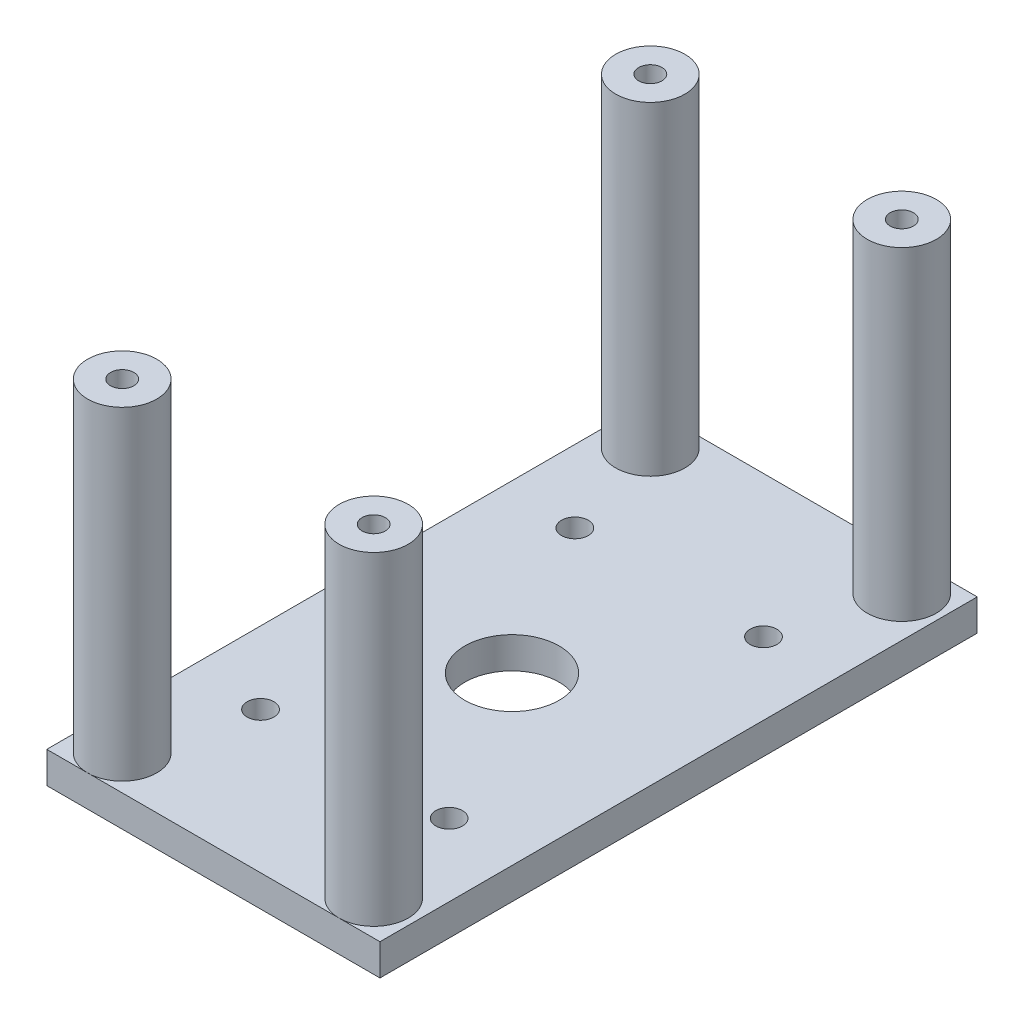
ISO-10303-21;
HEADER;
FILE_DESCRIPTION(('STEP AP214'),'2;1');
FILE_NAME('part.step','',(''),(''),'','','');
FILE_SCHEMA(('AUTOMOTIVE_DESIGN { 1 0 10303 214 1 1 1 1 }'));
ENDSEC;
DATA;
#1=APPLICATION_CONTEXT('core data for automotive mechanical design processes');
#2=APPLICATION_PROTOCOL_DEFINITION('international standard','automotive_design',2000,#1);
#3=PRODUCT_CONTEXT('',#1,'mechanical');
#4=PRODUCT('Part','Part','',(#3));
#5=PRODUCT_RELATED_PRODUCT_CATEGORY('part','',(#4));
#6=PRODUCT_DEFINITION_FORMATION('','',#4);
#7=PRODUCT_DEFINITION_CONTEXT('part definition',#1,'design');
#8=PRODUCT_DEFINITION('design','',#6,#7);
#9=PRODUCT_DEFINITION_SHAPE('','',#8);
#10=(LENGTH_UNIT() NAMED_UNIT(*) SI_UNIT(.MILLI.,.METRE.));
#11=(NAMED_UNIT(*) PLANE_ANGLE_UNIT() SI_UNIT($,.RADIAN.));
#12=(NAMED_UNIT(*) SI_UNIT($,.STERADIAN.) SOLID_ANGLE_UNIT());
#13=UNCERTAINTY_MEASURE_WITH_UNIT(LENGTH_MEASURE(1.E-05),#10,'distance_accuracy_value','');
#14=(GEOMETRIC_REPRESENTATION_CONTEXT(3) GLOBAL_UNCERTAINTY_ASSIGNED_CONTEXT((#13)) GLOBAL_UNIT_ASSIGNED_CONTEXT((#10,
#11,#12)) REPRESENTATION_CONTEXT('',''));
#15=CARTESIAN_POINT('',(0.,0.,0.));
#16=DIRECTION('',(0.,0.,1.));
#17=DIRECTION('',(1.,0.,0.));
#18=AXIS2_PLACEMENT_3D('',#15,#16,#17);
#19=CARTESIAN_POINT('',(0.,5.,0.));
#20=DIRECTION('',(1.,0.,0.));
#21=DIRECTION('',(0.,0.,-1.));
#22=AXIS2_PLACEMENT_3D('',#19,#20,#21);
#23=PLANE('',#22);
#24=DIRECTION('',(0.,0.,1.));
#25=VECTOR('',#24,1.);
#26=CARTESIAN_POINT('',(0.,0.,0.));
#27=LINE('',#26,#25);
#28=CARTESIAN_POINT('',(0.,0.,-95.));
#29=VERTEX_POINT('',#28);
#30=CARTESIAN_POINT('',(0.,0.,0.));
#31=VERTEX_POINT('',#30);
#32=EDGE_CURVE('E130',#29,#31,#27,.T.);
#33=ORIENTED_EDGE('',*,*,#32,.T.);
#34=DIRECTION('',(0.,-1.,0.));
#35=VECTOR('',#34,1.);
#36=CARTESIAN_POINT('',(0.,5.,0.));
#37=LINE('',#36,#35);
#38=CARTESIAN_POINT('',(0.,5.,0.));
#39=VERTEX_POINT('',#38);
#40=EDGE_CURVE('E11',#39,#31,#37,.T.);
#41=ORIENTED_EDGE('',*,*,#40,.F.);
#42=DIRECTION('',(0.,0.,1.));
#43=VECTOR('',#42,1.);
#44=CARTESIAN_POINT('',(0.,5.,0.));
#45=LINE('',#44,#43);
#46=CARTESIAN_POINT('',(0.,5.,-95.));
#47=VERTEX_POINT('',#46);
#48=EDGE_CURVE('E116',#47,#39,#45,.T.);
#49=ORIENTED_EDGE('',*,*,#48,.F.);
#50=DIRECTION('',(0.,-1.,0.));
#51=VECTOR('',#50,1.);
#52=CARTESIAN_POINT('',(0.,5.,-95.));
#53=LINE('',#52,#51);
#54=EDGE_CURVE('E129',#47,#29,#53,.T.);
#55=ORIENTED_EDGE('',*,*,#54,.T.);
#56=EDGE_LOOP('',(#33,#41,#49,#55));
#57=FACE_BOUND('',#56,.T.);
#58=ADVANCED_FACE('F39',(#57),#23,.F.);
#59=CARTESIAN_POINT('',(0.,5.,0.));
#60=DIRECTION('',(0.,0.,-1.));
#61=DIRECTION('',(-1.,0.,0.));
#62=AXIS2_PLACEMENT_3D('',#59,#60,#61);
#63=PLANE('',#62);
#64=DIRECTION('',(1.,0.,0.));
#65=VECTOR('',#64,1.);
#66=CARTESIAN_POINT('',(0.,0.,0.));
#67=LINE('',#66,#65);
#68=CARTESIAN_POINT('',(53.,0.,0.));
#69=VERTEX_POINT('',#68);
#70=EDGE_CURVE('E134',#31,#69,#67,.T.);
#71=ORIENTED_EDGE('',*,*,#70,.T.);
#72=DIRECTION('',(0.,-1.,0.));
#73=VECTOR('',#72,1.);
#74=CARTESIAN_POINT('',(53.,5.,0.));
#75=LINE('',#74,#73);
#76=CARTESIAN_POINT('',(53.,5.,0.));
#77=VERTEX_POINT('',#76);
#78=EDGE_CURVE('E48',#77,#69,#75,.T.);
#79=ORIENTED_EDGE('',*,*,#78,.F.);
#80=DIRECTION('',(1.,0.,0.));
#81=VECTOR('',#80,1.);
#82=CARTESIAN_POINT('',(0.,5.,0.));
#83=LINE('',#82,#81);
#84=CARTESIAN_POINT('',(46.5,5.,0.));
#85=VERTEX_POINT('',#84);
#86=EDGE_CURVE('E110',#85,#77,#83,.T.);
#87=ORIENTED_EDGE('',*,*,#86,.F.);
#88=CARTESIAN_POINT('',(6.50000000000001,5.,0.));
#89=VERTEX_POINT('',#88);
#90=EDGE_CURVE('E102',#89,#85,#83,.T.);
#91=ORIENTED_EDGE('',*,*,#90,.F.);
#92=EDGE_CURVE('E88',#39,#89,#83,.T.);
#93=ORIENTED_EDGE('',*,*,#92,.F.);
#94=ORIENTED_EDGE('',*,*,#40,.T.);
#95=EDGE_LOOP('',(#71,#79,#87,#91,#93,#94));
#96=FACE_BOUND('',#95,.T.);
#97=ADVANCED_FACE('F113',(#96),#63,.F.);
#98=CARTESIAN_POINT('',(53.,5.,0.));
#99=DIRECTION('',(-1.,0.,0.));
#100=DIRECTION('',(0.,0.,1.));
#101=AXIS2_PLACEMENT_3D('',#98,#99,#100);
#102=PLANE('',#101);
#103=DIRECTION('',(0.,0.,-1.));
#104=VECTOR('',#103,1.);
#105=CARTESIAN_POINT('',(53.,0.,0.));
#106=LINE('',#105,#104);
#107=CARTESIAN_POINT('',(53.,0.,-95.));
#108=VERTEX_POINT('',#107);
#109=EDGE_CURVE('E75',#69,#108,#106,.T.);
#110=ORIENTED_EDGE('',*,*,#109,.T.);
#111=DIRECTION('',(0.,-1.,0.));
#112=VECTOR('',#111,1.);
#113=CARTESIAN_POINT('',(53.,5.,-95.));
#114=LINE('',#113,#112);
#115=CARTESIAN_POINT('',(53.,5.,-95.));
#116=VERTEX_POINT('',#115);
#117=EDGE_CURVE('E144',#116,#108,#114,.T.);
#118=ORIENTED_EDGE('',*,*,#117,.F.);
#119=DIRECTION('',(0.,0.,-1.));
#120=VECTOR('',#119,1.);
#121=CARTESIAN_POINT('',(53.,5.,0.));
#122=LINE('',#121,#120);
#123=EDGE_CURVE('E121',#77,#116,#122,.T.);
#124=ORIENTED_EDGE('',*,*,#123,.F.);
#125=ORIENTED_EDGE('',*,*,#78,.T.);
#126=EDGE_LOOP('',(#110,#118,#124,#125));
#127=FACE_BOUND('',#126,.T.);
#128=ADVANCED_FACE('F147',(#127),#102,.F.);
#129=CARTESIAN_POINT('',(0.,5.,-95.));
#130=DIRECTION('',(0.,0.,1.));
#131=DIRECTION('',(1.,0.,0.));
#132=AXIS2_PLACEMENT_3D('',#129,#130,#131);
#133=PLANE('',#132);
#134=DIRECTION('',(-1.,0.,0.));
#135=VECTOR('',#134,1.);
#136=CARTESIAN_POINT('',(0.,0.,-95.));
#137=LINE('',#136,#135);
#138=EDGE_CURVE('E81',#108,#29,#137,.T.);
#139=ORIENTED_EDGE('',*,*,#138,.T.);
#140=ORIENTED_EDGE('',*,*,#54,.F.);
#141=DIRECTION('',(-1.,0.,0.));
#142=VECTOR('',#141,1.);
#143=CARTESIAN_POINT('',(0.,5.,-95.));
#144=LINE('',#143,#142);
#145=CARTESIAN_POINT('',(6.50000000000001,5.,-95.));
#146=VERTEX_POINT('',#145);
#147=EDGE_CURVE('E56',#146,#47,#144,.T.);
#148=ORIENTED_EDGE('',*,*,#147,.F.);
#149=CARTESIAN_POINT('',(46.5,5.,-95.));
#150=VERTEX_POINT('',#149);
#151=EDGE_CURVE('E124',#150,#146,#144,.T.);
#152=ORIENTED_EDGE('',*,*,#151,.F.);
#153=EDGE_CURVE('E126',#116,#150,#144,.T.);
#154=ORIENTED_EDGE('',*,*,#153,.F.);
#155=ORIENTED_EDGE('',*,*,#117,.T.);
#156=EDGE_LOOP('',(#139,#140,#148,#152,#154,#155));
#157=FACE_BOUND('',#156,.T.);
#158=ADVANCED_FACE('F154',(#157),#133,.F.);
#159=CARTESIAN_POINT('',(0.,5.,0.));
#160=DIRECTION('',(0.,-1.,0.));
#161=DIRECTION('',(0.,0.,-1.));
#162=AXIS2_PLACEMENT_3D('',#159,#160,#161);
#163=PLANE('',#162);
#164=CARTESIAN_POINT('',(41.5,5.,-22.5));
#165=DIRECTION('',(0.,1.,0.));
#166=DIRECTION('',(0.,0.,1.));
#167=AXIS2_PLACEMENT_3D('',#164,#165,#166);
#168=CIRCLE('',#167,2.125);
#169=CARTESIAN_POINT('',(41.5,5.,-20.375));
#170=VERTEX_POINT('',#169);
#171=EDGE_CURVE('E438',#170,#170,#168,.T.);
#172=ORIENTED_EDGE('',*,*,#171,.F.);
#173=EDGE_LOOP('',(#172));
#174=FACE_BOUND('',#173,.T.);
#175=CARTESIAN_POINT('',(11.5,5.,-22.5));
#176=DIRECTION('',(0.,1.,0.));
#177=DIRECTION('',(0.,0.,1.));
#178=AXIS2_PLACEMENT_3D('',#175,#176,#177);
#179=CIRCLE('',#178,2.125);
#180=CARTESIAN_POINT('',(11.5,5.,-20.375));
#181=VERTEX_POINT('',#180);
#182=EDGE_CURVE('E445',#181,#181,#179,.T.);
#183=ORIENTED_EDGE('',*,*,#182,.F.);
#184=EDGE_LOOP('',(#183));
#185=FACE_BOUND('',#184,.T.);
#186=CARTESIAN_POINT('',(41.5,5.,-72.5));
#187=DIRECTION('',(0.,1.,0.));
#188=DIRECTION('',(0.,0.,1.));
#189=AXIS2_PLACEMENT_3D('',#186,#187,#188);
#190=CIRCLE('',#189,2.125);
#191=CARTESIAN_POINT('',(41.5,5.,-70.375));
#192=VERTEX_POINT('',#191);
#193=EDGE_CURVE('E475',#192,#192,#190,.T.);
#194=ORIENTED_EDGE('',*,*,#193,.F.);
#195=EDGE_LOOP('',(#194));
#196=FACE_BOUND('',#195,.T.);
#197=CARTESIAN_POINT('',(11.5,5.,-72.5));
#198=DIRECTION('',(0.,1.,0.));
#199=DIRECTION('',(0.,0.,1.));
#200=AXIS2_PLACEMENT_3D('',#197,#198,#199);
#201=CIRCLE('',#200,2.125);
#202=CARTESIAN_POINT('',(11.5,5.,-70.375));
#203=VERTEX_POINT('',#202);
#204=EDGE_CURVE('E459',#203,#203,#201,.T.);
#205=ORIENTED_EDGE('',*,*,#204,.F.);
#206=EDGE_LOOP('',(#205));
#207=FACE_BOUND('',#206,.T.);
#208=CARTESIAN_POINT('',(26.5,5.,-47.5));
#209=DIRECTION('',(0.,1.,0.));
#210=DIRECTION('',(0.,0.,1.));
#211=AXIS2_PLACEMENT_3D('',#208,#209,#210);
#212=CIRCLE('',#211,7.5);
#213=CARTESIAN_POINT('',(26.5,5.,-40.));
#214=VERTEX_POINT('',#213);
#215=EDGE_CURVE('E455',#214,#214,#212,.T.);
#216=ORIENTED_EDGE('',*,*,#215,.F.);
#217=EDGE_LOOP('',(#216));
#218=FACE_BOUND('',#217,.T.);
#219=ORIENTED_EDGE('',*,*,#90,.T.);
#220=CARTESIAN_POINT('',(46.5,5.,-5.49999999999999));
#221=DIRECTION('',(0.,1.,0.));
#222=DIRECTION('',(0.,0.,1.));
#223=AXIS2_PLACEMENT_3D('',#220,#221,#222);
#224=CIRCLE('',#223,5.49999999999999);
#225=EDGE_CURVE('E106',#85,#85,#224,.T.);
#226=ORIENTED_EDGE('',*,*,#225,.F.);
#227=ORIENTED_EDGE('',*,*,#86,.T.);
#228=ORIENTED_EDGE('',*,*,#123,.T.);
#229=ORIENTED_EDGE('',*,*,#153,.T.);
#230=CARTESIAN_POINT('',(46.5,5.,-89.5));
#231=DIRECTION('',(0.,1.,0.));
#232=DIRECTION('',(0.,0.,1.));
#233=AXIS2_PLACEMENT_3D('',#230,#231,#232);
#234=CIRCLE('',#233,5.5);
#235=EDGE_CURVE('E179',#150,#150,#234,.T.);
#236=ORIENTED_EDGE('',*,*,#235,.F.);
#237=ORIENTED_EDGE('',*,*,#151,.T.);
#238=CARTESIAN_POINT('',(6.50000000000001,5.,-89.5));
#239=DIRECTION('',(0.,1.,0.));
#240=DIRECTION('',(0.,0.,1.));
#241=AXIS2_PLACEMENT_3D('',#238,#239,#240);
#242=CIRCLE('',#241,5.50000000000001);
#243=EDGE_CURVE('E159',#146,#146,#242,.T.);
#244=ORIENTED_EDGE('',*,*,#243,.F.);
#245=ORIENTED_EDGE('',*,*,#147,.T.);
#246=ORIENTED_EDGE('',*,*,#48,.T.);
#247=ORIENTED_EDGE('',*,*,#92,.T.);
#248=CARTESIAN_POINT('',(6.50000000000001,5.,-5.49999999999999));
#249=DIRECTION('',(0.,1.,0.));
#250=DIRECTION('',(0.,0.,1.));
#251=AXIS2_PLACEMENT_3D('',#248,#249,#250);
#252=CIRCLE('',#251,5.49999999999999);
#253=EDGE_CURVE('E108',#89,#89,#252,.T.);
#254=ORIENTED_EDGE('',*,*,#253,.F.);
#255=EDGE_LOOP('',(#219,#226,#227,#228,#229,#236,#237,#244,#245,#246,#247,#254));
#256=FACE_BOUND('',#255,.T.);
#257=ADVANCED_FACE('F104',(#174,#185,#196,#207,#218,#256),#163,.F.);
#258=CARTESIAN_POINT('',(0.,0.,0.));
#259=DIRECTION('',(0.,-1.,0.));
#260=DIRECTION('',(0.,0.,-1.));
#261=AXIS2_PLACEMENT_3D('',#258,#259,#260);
#262=PLANE('',#261);
#263=CARTESIAN_POINT('',(41.5,0.,-22.5));
#264=DIRECTION('',(0.,1.,0.));
#265=DIRECTION('',(0.,0.,1.));
#266=AXIS2_PLACEMENT_3D('',#263,#264,#265);
#267=CIRCLE('',#266,2.125);
#268=CARTESIAN_POINT('',(41.5,0.,-20.375));
#269=VERTEX_POINT('',#268);
#270=EDGE_CURVE('E436',#269,#269,#267,.T.);
#271=ORIENTED_EDGE('',*,*,#270,.T.);
#272=EDGE_LOOP('',(#271));
#273=FACE_BOUND('',#272,.T.);
#274=CARTESIAN_POINT('',(11.5,0.,-22.5));
#275=DIRECTION('',(0.,1.,0.));
#276=DIRECTION('',(0.,0.,1.));
#277=AXIS2_PLACEMENT_3D('',#274,#275,#276);
#278=CIRCLE('',#277,2.125);
#279=CARTESIAN_POINT('',(11.5,0.,-20.375));
#280=VERTEX_POINT('',#279);
#281=EDGE_CURVE('E440',#280,#280,#278,.T.);
#282=ORIENTED_EDGE('',*,*,#281,.T.);
#283=EDGE_LOOP('',(#282));
#284=FACE_BOUND('',#283,.T.);
#285=CARTESIAN_POINT('',(41.5,0.,-72.5));
#286=DIRECTION('',(0.,1.,0.));
#287=DIRECTION('',(0.,0.,1.));
#288=AXIS2_PLACEMENT_3D('',#285,#286,#287);
#289=CIRCLE('',#288,2.125);
#290=CARTESIAN_POINT('',(41.5,0.,-70.375));
#291=VERTEX_POINT('',#290);
#292=EDGE_CURVE('E479',#291,#291,#289,.T.);
#293=ORIENTED_EDGE('',*,*,#292,.T.);
#294=EDGE_LOOP('',(#293));
#295=FACE_BOUND('',#294,.T.);
#296=CARTESIAN_POINT('',(11.5,0.,-72.5));
#297=DIRECTION('',(0.,1.,0.));
#298=DIRECTION('',(0.,0.,1.));
#299=AXIS2_PLACEMENT_3D('',#296,#297,#298);
#300=CIRCLE('',#299,2.125);
#301=CARTESIAN_POINT('',(11.5,0.,-70.375));
#302=VERTEX_POINT('',#301);
#303=EDGE_CURVE('E471',#302,#302,#300,.T.);
#304=ORIENTED_EDGE('',*,*,#303,.T.);
#305=EDGE_LOOP('',(#304));
#306=FACE_BOUND('',#305,.T.);
#307=CARTESIAN_POINT('',(26.5,0.,-47.5));
#308=DIRECTION('',(0.,1.,0.));
#309=DIRECTION('',(0.,0.,1.));
#310=AXIS2_PLACEMENT_3D('',#307,#308,#309);
#311=CIRCLE('',#310,7.5);
#312=CARTESIAN_POINT('',(26.5,0.,-40.));
#313=VERTEX_POINT('',#312);
#314=EDGE_CURVE('E450',#313,#313,#311,.T.);
#315=ORIENTED_EDGE('',*,*,#314,.T.);
#316=EDGE_LOOP('',(#315));
#317=FACE_BOUND('',#316,.T.);
#318=ORIENTED_EDGE('',*,*,#32,.F.);
#319=ORIENTED_EDGE('',*,*,#138,.F.);
#320=ORIENTED_EDGE('',*,*,#109,.F.);
#321=ORIENTED_EDGE('',*,*,#70,.F.);
#322=EDGE_LOOP('',(#318,#319,#320,#321));
#323=FACE_BOUND('',#322,.T.);
#324=ADVANCED_FACE('F150',(#273,#284,#295,#306,#317,#323),#262,.T.);
#325=CARTESIAN_POINT('',(46.5,56.5,-89.5));
#326=DIRECTION('',(0.,1.,0.));
#327=DIRECTION('',(0.,0.,1.));
#328=AXIS2_PLACEMENT_3D('',#325,#326,#327);
#329=PLANE('',#328);
#330=CARTESIAN_POINT('',(46.5,56.5,-89.5));
#331=DIRECTION('',(0.,1.,0.));
#332=DIRECTION('',(0.,0.,1.));
#333=AXIS2_PLACEMENT_3D('',#330,#331,#332);
#334=CIRCLE('',#333,5.5);
#335=CARTESIAN_POINT('',(46.5,56.5,-84.));
#336=VERTEX_POINT('',#335);
#337=EDGE_CURVE('E135',#336,#336,#334,.T.);
#338=ORIENTED_EDGE('',*,*,#337,.T.);
#339=EDGE_LOOP('',(#338));
#340=FACE_BOUND('',#339,.T.);
#341=CARTESIAN_POINT('',(46.5,56.5,-89.5));
#342=DIRECTION('',(0.,1.,0.));
#343=DIRECTION('',(0.,0.,1.));
#344=AXIS2_PLACEMENT_3D('',#341,#342,#343);
#345=CIRCLE('',#344,1.85);
#346=CARTESIAN_POINT('',(46.5,56.5,-87.65));
#347=VERTEX_POINT('',#346);
#348=EDGE_CURVE('E175',#347,#347,#345,.T.);
#349=ORIENTED_EDGE('',*,*,#348,.F.);
#350=EDGE_LOOP('',(#349));
#351=FACE_BOUND('',#350,.T.);
#352=ADVANCED_FACE('F192',(#340,#351),#329,.T.);
#353=CARTESIAN_POINT('',(46.5,56.5,-89.5));
#354=DIRECTION('',(0.,-1.,0.));
#355=DIRECTION('',(0.,0.,-1.));
#356=AXIS2_PLACEMENT_3D('',#353,#354,#355);
#357=CYLINDRICAL_SURFACE('',#356,5.5);
#358=ORIENTED_EDGE('',*,*,#337,.F.);
#359=EDGE_LOOP('',(#358));
#360=FACE_BOUND('',#359,.T.);
#361=ORIENTED_EDGE('',*,*,#235,.T.);
#362=EDGE_LOOP('',(#361));
#363=FACE_BOUND('',#362,.T.);
#364=ADVANCED_FACE('F189',(#360,#363),#357,.T.);
#365=CARTESIAN_POINT('',(46.5,56.5,-89.5));
#366=DIRECTION('',(0.,-1.,0.));
#367=DIRECTION('',(0.,0.,-1.));
#368=AXIS2_PLACEMENT_3D('',#365,#366,#367);
#369=CYLINDRICAL_SURFACE('',#368,1.85);
#370=ORIENTED_EDGE('',*,*,#348,.T.);
#371=EDGE_LOOP('',(#370));
#372=FACE_BOUND('',#371,.T.);
#373=CARTESIAN_POINT('',(46.5,5.,-89.5));
#374=DIRECTION('',(0.,1.,0.));
#375=DIRECTION('',(0.,0.,1.));
#376=AXIS2_PLACEMENT_3D('',#373,#374,#375);
#377=CIRCLE('',#376,1.85);
#378=CARTESIAN_POINT('',(46.5,5.,-87.65));
#379=VERTEX_POINT('',#378);
#380=EDGE_CURVE('E168',#379,#379,#377,.T.);
#381=ORIENTED_EDGE('',*,*,#380,.F.);
#382=EDGE_LOOP('',(#381));
#383=FACE_BOUND('',#382,.T.);
#384=ADVANCED_FACE('F191',(#372,#383),#369,.F.);
#385=ORIENTED_EDGE('',*,*,#380,.T.);
#386=EDGE_LOOP('',(#385));
#387=FACE_BOUND('',#386,.T.);
#388=ADVANCED_FACE('F199',(#387),#163,.F.);
#389=CARTESIAN_POINT('',(6.50000000000001,56.5,-89.5));
#390=DIRECTION('',(0.,1.,0.));
#391=DIRECTION('',(0.,0.,1.));
#392=AXIS2_PLACEMENT_3D('',#389,#390,#391);
#393=PLANE('',#392);
#394=CARTESIAN_POINT('',(6.50000000000001,56.5,-89.5));
#395=DIRECTION('',(0.,1.,0.));
#396=DIRECTION('',(0.,0.,1.));
#397=AXIS2_PLACEMENT_3D('',#394,#395,#396);
#398=CIRCLE('',#397,5.50000000000001);
#399=CARTESIAN_POINT('',(6.50000000000001,56.5,-84.));
#400=VERTEX_POINT('',#399);
#401=EDGE_CURVE('E162',#400,#400,#398,.T.);
#402=ORIENTED_EDGE('',*,*,#401,.T.);
#403=EDGE_LOOP('',(#402));
#404=FACE_BOUND('',#403,.T.);
#405=CARTESIAN_POINT('',(6.50000000000001,56.5,-89.5));
#406=DIRECTION('',(0.,1.,0.));
#407=DIRECTION('',(0.,0.,1.));
#408=AXIS2_PLACEMENT_3D('',#405,#406,#407);
#409=CIRCLE('',#408,1.85);
#410=CARTESIAN_POINT('',(6.50000000000001,56.5,-87.65));
#411=VERTEX_POINT('',#410);
#412=EDGE_CURVE('E163',#411,#411,#409,.T.);
#413=ORIENTED_EDGE('',*,*,#412,.F.);
#414=EDGE_LOOP('',(#413));
#415=FACE_BOUND('',#414,.T.);
#416=ADVANCED_FACE('F232',(#404,#415),#393,.T.);
#417=CARTESIAN_POINT('',(6.50000000000001,56.5,-89.5));
#418=DIRECTION('',(0.,-1.,0.));
#419=DIRECTION('',(0.,0.,-1.));
#420=AXIS2_PLACEMENT_3D('',#417,#418,#419);
#421=CYLINDRICAL_SURFACE('',#420,5.50000000000001);
#422=ORIENTED_EDGE('',*,*,#401,.F.);
#423=EDGE_LOOP('',(#422));
#424=FACE_BOUND('',#423,.T.);
#425=ORIENTED_EDGE('',*,*,#243,.T.);
#426=EDGE_LOOP('',(#425));
#427=FACE_BOUND('',#426,.T.);
#428=ADVANCED_FACE('F238',(#424,#427),#421,.T.);
#429=CARTESIAN_POINT('',(6.50000000000001,56.5,-89.5));
#430=DIRECTION('',(0.,-1.,0.));
#431=DIRECTION('',(0.,0.,-1.));
#432=AXIS2_PLACEMENT_3D('',#429,#430,#431);
#433=CYLINDRICAL_SURFACE('',#432,1.85);
#434=ORIENTED_EDGE('',*,*,#412,.T.);
#435=EDGE_LOOP('',(#434));
#436=FACE_BOUND('',#435,.T.);
#437=CARTESIAN_POINT('',(6.50000000000001,5.,-89.5));
#438=DIRECTION('',(0.,1.,0.));
#439=DIRECTION('',(0.,0.,1.));
#440=AXIS2_PLACEMENT_3D('',#437,#438,#439);
#441=CIRCLE('',#440,1.85);
#442=CARTESIAN_POINT('',(6.50000000000001,5.,-87.65));
#443=VERTEX_POINT('',#442);
#444=EDGE_CURVE('E171',#443,#443,#441,.T.);
#445=ORIENTED_EDGE('',*,*,#444,.F.);
#446=EDGE_LOOP('',(#445));
#447=FACE_BOUND('',#446,.T.);
#448=ADVANCED_FACE('F243',(#436,#447),#433,.F.);
#449=ORIENTED_EDGE('',*,*,#444,.T.);
#450=EDGE_LOOP('',(#449));
#451=FACE_BOUND('',#450,.T.);
#452=ADVANCED_FACE('F234',(#451),#163,.F.);
#453=CARTESIAN_POINT('',(6.50000000000001,56.5,-5.49999999999999));
#454=DIRECTION('',(0.,1.,0.));
#455=DIRECTION('',(0.,0.,1.));
#456=AXIS2_PLACEMENT_3D('',#453,#454,#455);
#457=PLANE('',#456);
#458=CARTESIAN_POINT('',(6.50000000000001,56.5,-5.49999999999999));
#459=DIRECTION('',(0.,1.,0.));
#460=DIRECTION('',(0.,0.,1.));
#461=AXIS2_PLACEMENT_3D('',#458,#459,#460);
#462=CIRCLE('',#461,5.49999999999999);
#463=CARTESIAN_POINT('',(6.50000000000001,56.5,0.));
#464=VERTEX_POINT('',#463);
#465=EDGE_CURVE('E284',#464,#464,#462,.T.);
#466=ORIENTED_EDGE('',*,*,#465,.T.);
#467=EDGE_LOOP('',(#466));
#468=FACE_BOUND('',#467,.T.);
#469=CARTESIAN_POINT('',(6.50000000000001,56.5,-5.49999999999999));
#470=DIRECTION('',(0.,1.,0.));
#471=DIRECTION('',(0.,0.,1.));
#472=AXIS2_PLACEMENT_3D('',#469,#470,#471);
#473=CIRCLE('',#472,1.85);
#474=CARTESIAN_POINT('',(6.50000000000001,56.5,-3.64999999999999));
#475=VERTEX_POINT('',#474);
#476=EDGE_CURVE('E273',#475,#475,#473,.T.);
#477=ORIENTED_EDGE('',*,*,#476,.F.);
#478=EDGE_LOOP('',(#477));
#479=FACE_BOUND('',#478,.T.);
#480=ADVANCED_FACE('F242',(#468,#479),#457,.T.);
#481=CARTESIAN_POINT('',(6.50000000000001,56.5,-5.49999999999999));
#482=DIRECTION('',(0.,-1.,0.));
#483=DIRECTION('',(0.,0.,-1.));
#484=AXIS2_PLACEMENT_3D('',#481,#482,#483);
#485=CYLINDRICAL_SURFACE('',#484,5.49999999999999);
#486=ORIENTED_EDGE('',*,*,#465,.F.);
#487=EDGE_LOOP('',(#486));
#488=FACE_BOUND('',#487,.T.);
#489=ORIENTED_EDGE('',*,*,#253,.T.);
#490=EDGE_LOOP('',(#489));
#491=FACE_BOUND('',#490,.T.);
#492=ADVANCED_FACE('F249',(#488,#491),#485,.T.);
#493=CARTESIAN_POINT('',(6.50000000000001,56.5,-5.49999999999999));
#494=DIRECTION('',(0.,-1.,0.));
#495=DIRECTION('',(0.,0.,-1.));
#496=AXIS2_PLACEMENT_3D('',#493,#494,#495);
#497=CYLINDRICAL_SURFACE('',#496,1.85);
#498=ORIENTED_EDGE('',*,*,#476,.T.);
#499=EDGE_LOOP('',(#498));
#500=FACE_BOUND('',#499,.T.);
#501=CARTESIAN_POINT('',(6.50000000000001,5.,-5.49999999999999));
#502=DIRECTION('',(0.,1.,0.));
#503=DIRECTION('',(0.,0.,1.));
#504=AXIS2_PLACEMENT_3D('',#501,#502,#503);
#505=CIRCLE('',#504,1.85);
#506=CARTESIAN_POINT('',(6.50000000000001,5.,-3.64999999999999));
#507=VERTEX_POINT('',#506);
#508=EDGE_CURVE('E270',#507,#507,#505,.T.);
#509=ORIENTED_EDGE('',*,*,#508,.F.);
#510=EDGE_LOOP('',(#509));
#511=FACE_BOUND('',#510,.T.);
#512=ADVANCED_FACE('F257',(#500,#511),#497,.F.);
#513=ORIENTED_EDGE('',*,*,#508,.T.);
#514=EDGE_LOOP('',(#513));
#515=FACE_BOUND('',#514,.T.);
#516=ADVANCED_FACE('F230',(#515),#163,.F.);
#517=CARTESIAN_POINT('',(46.5,56.5,-5.49999999999999));
#518=DIRECTION('',(0.,1.,0.));
#519=DIRECTION('',(0.,0.,1.));
#520=AXIS2_PLACEMENT_3D('',#517,#518,#519);
#521=PLANE('',#520);
#522=CARTESIAN_POINT('',(46.5,56.5,-5.49999999999999));
#523=DIRECTION('',(0.,1.,0.));
#524=DIRECTION('',(0.,0.,1.));
#525=AXIS2_PLACEMENT_3D('',#522,#523,#524);
#526=CIRCLE('',#525,5.49999999999999);
#527=CARTESIAN_POINT('',(46.5,56.5,0.));
#528=VERTEX_POINT('',#527);
#529=EDGE_CURVE('E274',#528,#528,#526,.T.);
#530=ORIENTED_EDGE('',*,*,#529,.T.);
#531=EDGE_LOOP('',(#530));
#532=FACE_BOUND('',#531,.T.);
#533=CARTESIAN_POINT('',(46.5,56.5,-5.49999999999999));
#534=DIRECTION('',(0.,1.,0.));
#535=DIRECTION('',(0.,0.,1.));
#536=AXIS2_PLACEMENT_3D('',#533,#534,#535);
#537=CIRCLE('',#536,1.85);
#538=CARTESIAN_POINT('',(46.5,56.5,-3.64999999999999));
#539=VERTEX_POINT('',#538);
#540=EDGE_CURVE('E460',#539,#539,#537,.T.);
#541=ORIENTED_EDGE('',*,*,#540,.F.);
#542=EDGE_LOOP('',(#541));
#543=FACE_BOUND('',#542,.T.);
#544=ADVANCED_FACE('F256',(#532,#543),#521,.T.);
#545=CARTESIAN_POINT('',(46.5,56.5,-5.49999999999999));
#546=DIRECTION('',(0.,-1.,0.));
#547=DIRECTION('',(0.,0.,-1.));
#548=AXIS2_PLACEMENT_3D('',#545,#546,#547);
#549=CYLINDRICAL_SURFACE('',#548,5.49999999999999);
#550=ORIENTED_EDGE('',*,*,#529,.F.);
#551=EDGE_LOOP('',(#550));
#552=FACE_BOUND('',#551,.T.);
#553=ORIENTED_EDGE('',*,*,#225,.T.);
#554=EDGE_LOOP('',(#553));
#555=FACE_BOUND('',#554,.T.);
#556=ADVANCED_FACE('F263',(#552,#555),#549,.T.);
#557=CARTESIAN_POINT('',(46.5,56.5,-5.49999999999999));
#558=DIRECTION('',(0.,-1.,0.));
#559=DIRECTION('',(0.,0.,-1.));
#560=AXIS2_PLACEMENT_3D('',#557,#558,#559);
#561=CYLINDRICAL_SURFACE('',#560,1.85);
#562=ORIENTED_EDGE('',*,*,#540,.T.);
#563=EDGE_LOOP('',(#562));
#564=FACE_BOUND('',#563,.T.);
#565=CARTESIAN_POINT('',(46.5,5.,-5.49999999999999));
#566=DIRECTION('',(0.,1.,0.));
#567=DIRECTION('',(0.,0.,1.));
#568=AXIS2_PLACEMENT_3D('',#565,#566,#567);
#569=CIRCLE('',#568,1.85);
#570=CARTESIAN_POINT('',(46.5,5.,-3.64999999999999));
#571=VERTEX_POINT('',#570);
#572=EDGE_CURVE('E454',#571,#571,#569,.T.);
#573=ORIENTED_EDGE('',*,*,#572,.F.);
#574=EDGE_LOOP('',(#573));
#575=FACE_BOUND('',#574,.T.);
#576=ADVANCED_FACE('F228',(#564,#575),#561,.F.);
#577=ORIENTED_EDGE('',*,*,#572,.T.);
#578=EDGE_LOOP('',(#577));
#579=FACE_BOUND('',#578,.T.);
#580=ADVANCED_FACE('F221',(#579),#163,.F.);
#581=CARTESIAN_POINT('',(26.5,0.,-47.5));
#582=DIRECTION('',(0.,1.,0.));
#583=DIRECTION('',(0.,0.,1.));
#584=AXIS2_PLACEMENT_3D('',#581,#582,#583);
#585=CYLINDRICAL_SURFACE('',#584,7.5);
#586=ORIENTED_EDGE('',*,*,#314,.F.);
#587=EDGE_LOOP('',(#586));
#588=FACE_BOUND('',#587,.T.);
#589=ORIENTED_EDGE('',*,*,#215,.T.);
#590=EDGE_LOOP('',(#589));
#591=FACE_BOUND('',#590,.T.);
#592=ADVANCED_FACE('F227',(#588,#591),#585,.F.);
#593=CARTESIAN_POINT('',(11.5,0.,-72.5));
#594=DIRECTION('',(0.,1.,0.));
#595=DIRECTION('',(0.,0.,1.));
#596=AXIS2_PLACEMENT_3D('',#593,#594,#595);
#597=CYLINDRICAL_SURFACE('',#596,2.125);
#598=ORIENTED_EDGE('',*,*,#303,.F.);
#599=EDGE_LOOP('',(#598));
#600=FACE_BOUND('',#599,.T.);
#601=ORIENTED_EDGE('',*,*,#204,.T.);
#602=EDGE_LOOP('',(#601));
#603=FACE_BOUND('',#602,.T.);
#604=ADVANCED_FACE('F389',(#600,#603),#597,.F.);
#605=CARTESIAN_POINT('',(41.5,0.,-72.5));
#606=DIRECTION('',(0.,1.,0.));
#607=DIRECTION('',(0.,0.,1.));
#608=AXIS2_PLACEMENT_3D('',#605,#606,#607);
#609=CYLINDRICAL_SURFACE('',#608,2.125);
#610=ORIENTED_EDGE('',*,*,#292,.F.);
#611=EDGE_LOOP('',(#610));
#612=FACE_BOUND('',#611,.T.);
#613=ORIENTED_EDGE('',*,*,#193,.T.);
#614=EDGE_LOOP('',(#613));
#615=FACE_BOUND('',#614,.T.);
#616=ADVANCED_FACE('F399',(#612,#615),#609,.F.);
#617=CARTESIAN_POINT('',(11.5,0.,-22.5));
#618=DIRECTION('',(0.,1.,0.));
#619=DIRECTION('',(0.,0.,1.));
#620=AXIS2_PLACEMENT_3D('',#617,#618,#619);
#621=CYLINDRICAL_SURFACE('',#620,2.125);
#622=ORIENTED_EDGE('',*,*,#281,.F.);
#623=EDGE_LOOP('',(#622));
#624=FACE_BOUND('',#623,.T.);
#625=ORIENTED_EDGE('',*,*,#182,.T.);
#626=EDGE_LOOP('',(#625));
#627=FACE_BOUND('',#626,.T.);
#628=ADVANCED_FACE('F409',(#624,#627),#621,.F.);
#629=CARTESIAN_POINT('',(41.5,0.,-22.5));
#630=DIRECTION('',(0.,1.,0.));
#631=DIRECTION('',(0.,0.,1.));
#632=AXIS2_PLACEMENT_3D('',#629,#630,#631);
#633=CYLINDRICAL_SURFACE('',#632,2.125);
#634=ORIENTED_EDGE('',*,*,#270,.F.);
#635=EDGE_LOOP('',(#634));
#636=FACE_BOUND('',#635,.T.);
#637=ORIENTED_EDGE('',*,*,#171,.T.);
#638=EDGE_LOOP('',(#637));
#639=FACE_BOUND('',#638,.T.);
#640=ADVANCED_FACE('F419',(#636,#639),#633,.F.);
#641=CLOSED_SHELL('',(#58,#97,#128,#158,#257,#324,#352,#364,#384,#388,#416,#428,#448,#452,#480,
#492,#512,#516,#544,#556,#576,#580,#592,#604,#616,#628,#640));
#642=MANIFOLD_SOLID_BREP('B2',#641);
#643=ADVANCED_BREP_SHAPE_REPRESENTATION('',(#18,#642),#14);
#644=SHAPE_DEFINITION_REPRESENTATION(#9,#643);
ENDSEC;
END-ISO-10303-21;
